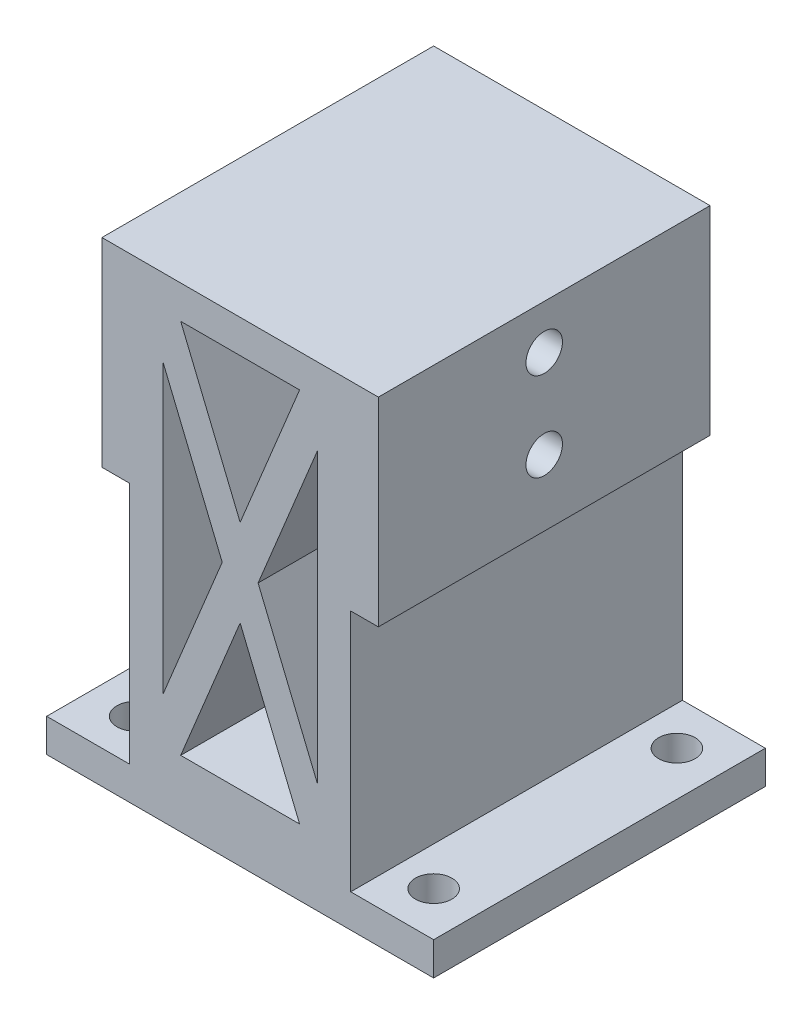
ISO-10303-21;
HEADER;
FILE_DESCRIPTION(('STEP AP214'),'2;1');
FILE_NAME('part.step','',(''),(''),'','','');
FILE_SCHEMA(('AUTOMOTIVE_DESIGN { 1 0 10303 214 1 1 1 1 }'));
ENDSEC;
DATA;
#1=APPLICATION_CONTEXT('core data for automotive mechanical design processes');
#2=APPLICATION_PROTOCOL_DEFINITION('international standard','automotive_design',2000,#1);
#3=PRODUCT_CONTEXT('',#1,'mechanical');
#4=PRODUCT('Part','Part','',(#3));
#5=PRODUCT_RELATED_PRODUCT_CATEGORY('part','',(#4));
#6=PRODUCT_DEFINITION_FORMATION('','',#4);
#7=PRODUCT_DEFINITION_CONTEXT('part definition',#1,'design');
#8=PRODUCT_DEFINITION('design','',#6,#7);
#9=PRODUCT_DEFINITION_SHAPE('','',#8);
#10=(LENGTH_UNIT() NAMED_UNIT(*) SI_UNIT(.MILLI.,.METRE.));
#11=(NAMED_UNIT(*) PLANE_ANGLE_UNIT() SI_UNIT($,.RADIAN.));
#12=(NAMED_UNIT(*) SI_UNIT($,.STERADIAN.) SOLID_ANGLE_UNIT());
#13=UNCERTAINTY_MEASURE_WITH_UNIT(LENGTH_MEASURE(1.E-05),#10,'distance_accuracy_value','');
#14=(GEOMETRIC_REPRESENTATION_CONTEXT(3) GLOBAL_UNCERTAINTY_ASSIGNED_CONTEXT((#13)) GLOBAL_UNIT_ASSIGNED_CONTEXT((#10,
#11,#12)) REPRESENTATION_CONTEXT('',''));
#15=CARTESIAN_POINT('',(0.,0.,0.));
#16=DIRECTION('',(0.,0.,1.));
#17=DIRECTION('',(1.,0.,0.));
#18=AXIS2_PLACEMENT_3D('',#15,#16,#17);
#19=CARTESIAN_POINT('',(0.,38.5,41.6686633500967));
#20=DIRECTION('',(0.,1.,0.));
#21=DIRECTION('',(0.,0.,1.));
#22=AXIS2_PLACEMENT_3D('',#19,#20,#21);
#23=PLANE('',#22);
#24=DIRECTION('',(0.,0.,-1.));
#25=VECTOR('',#24,1.);
#26=CARTESIAN_POINT('',(5.37781385492498,38.5,41.6686633500967));
#27=LINE('',#26,#25);
#28=CARTESIAN_POINT('',(5.37781385492498,38.5,-1.31244047484067));
#29=VERTEX_POINT('',#28);
#30=CARTESIAN_POINT('',(5.37781385492498,38.5,-15.));
#31=VERTEX_POINT('',#30);
#32=EDGE_CURVE('E295',#29,#31,#27,.T.);
#33=ORIENTED_EDGE('',*,*,#32,.F.);
#34=DIRECTION('',(-1.,0.,0.));
#35=VECTOR('',#34,1.);
#36=CARTESIAN_POINT('',(17.1669047558312,38.5,-1.31244047484067));
#37=LINE('',#36,#35);
#38=CARTESIAN_POINT('',(-5.37781385492498,38.5,-1.31244047484066));
#39=VERTEX_POINT('',#38);
#40=EDGE_CURVE('E285',#29,#39,#37,.T.);
#41=ORIENTED_EDGE('',*,*,#40,.T.);
#42=DIRECTION('',(0.,0.,-1.));
#43=VECTOR('',#42,1.);
#44=CARTESIAN_POINT('',(-5.37781385492498,38.5,41.6686633500967));
#45=LINE('',#44,#43);
#46=CARTESIAN_POINT('',(-5.37781385492498,38.5,-15.));
#47=VERTEX_POINT('',#46);
#48=EDGE_CURVE('E293',#39,#47,#45,.T.);
#49=ORIENTED_EDGE('',*,*,#48,.T.);
#50=DIRECTION('',(1.,0.,0.));
#51=VECTOR('',#50,1.);
#52=CARTESIAN_POINT('',(0.,38.5,-15.));
#53=LINE('',#52,#51);
#54=EDGE_CURVE('E306',#47,#31,#53,.T.);
#55=ORIENTED_EDGE('',*,*,#54,.T.);
#56=EDGE_LOOP('',(#33,#41,#49,#55));
#57=FACE_BOUND('',#56,.T.);
#58=ADVANCED_FACE('F112',(#57),#23,.F.);
#59=CARTESIAN_POINT('',(-17.5,1.5,-15.));
#60=DIRECTION('',(0.,0.,1.));
#61=DIRECTION('',(1.,0.,0.));
#62=AXIS2_PLACEMENT_3D('',#59,#60,#61);
#63=PLANE('',#62);
#64=DIRECTION('',(0.380749805254295,0.924678098474716,0.));
#65=VECTOR('',#64,1.);
#66=CARTESIAN_POINT('',(-8.95654377493101,3.68798861320689,-15.));
#67=LINE('',#66,#65);
#68=CARTESIAN_POINT('',(0.,25.4395949237536,-15.));
#69=VERTEX_POINT('',#68);
#70=EDGE_CURVE('E506',#69,#31,#67,.T.);
#71=ORIENTED_EDGE('',*,*,#70,.T.);
#72=ORIENTED_EDGE('',*,*,#54,.F.);
#73=DIRECTION('',(-0.380749805254295,0.924678098474716,0.));
#74=VECTOR('',#73,1.);
#75=CARTESIAN_POINT('',(8.956543774931,3.68798861320688,-15.));
#76=LINE('',#75,#74);
#77=EDGE_CURVE('E301',#69,#47,#76,.T.);
#78=ORIENTED_EDGE('',*,*,#77,.F.);
#79=EDGE_LOOP('',(#71,#72,#78));
#80=FACE_BOUND('',#79,.T.);
#81=DIRECTION('',(-1.,0.,0.));
#82=VECTOR('',#81,1.);
#83=CARTESIAN_POINT('',(-17.5,-1.5,-15.));
#84=LINE('',#83,#82);
#85=CARTESIAN_POINT('',(17.5,-1.5,-15.));
#86=VERTEX_POINT('',#85);
#87=CARTESIAN_POINT('',(-17.5,-1.5,-15.));
#88=VERTEX_POINT('',#87);
#89=EDGE_CURVE('E411',#86,#88,#84,.T.);
#90=ORIENTED_EDGE('',*,*,#89,.T.);
#91=DIRECTION('',(0.,-1.,0.));
#92=VECTOR('',#91,1.);
#93=CARTESIAN_POINT('',(-17.5,1.5,-15.));
#94=LINE('',#93,#92);
#95=CARTESIAN_POINT('',(-17.5,1.5,-15.));
#96=VERTEX_POINT('',#95);
#97=EDGE_CURVE('E421',#96,#88,#94,.T.);
#98=ORIENTED_EDGE('',*,*,#97,.F.);
#99=DIRECTION('',(-1.,0.,0.));
#100=VECTOR('',#99,1.);
#101=CARTESIAN_POINT('',(-17.5,1.5,-15.));
#102=LINE('',#101,#100);
#103=CARTESIAN_POINT('',(-10.,1.5,-15.));
#104=VERTEX_POINT('',#103);
#105=EDGE_CURVE('E397',#104,#96,#102,.T.);
#106=ORIENTED_EDGE('',*,*,#105,.F.);
#107=DIRECTION('',(0.,-1.,0.));
#108=VECTOR('',#107,1.);
#109=CARTESIAN_POINT('',(-10.,41.5,-15.));
#110=LINE('',#109,#108);
#111=CARTESIAN_POINT('',(-10.,23.5,-15.));
#112=VERTEX_POINT('',#111);
#113=EDGE_CURVE('E365',#112,#104,#110,.T.);
#114=ORIENTED_EDGE('',*,*,#113,.F.);
#115=DIRECTION('',(1.,0.,0.));
#116=VECTOR('',#115,1.);
#117=CARTESIAN_POINT('',(-12.5,23.5,-15.));
#118=LINE('',#117,#116);
#119=CARTESIAN_POINT('',(-12.5,23.5,-15.));
#120=VERTEX_POINT('',#119);
#121=EDGE_CURVE('E327',#120,#112,#118,.T.);
#122=ORIENTED_EDGE('',*,*,#121,.F.);
#123=DIRECTION('',(0.,1.,0.));
#124=VECTOR('',#123,1.);
#125=CARTESIAN_POINT('',(-12.5,0.,-15.));
#126=LINE('',#125,#124);
#127=CARTESIAN_POINT('',(-12.5,41.5,-15.));
#128=VERTEX_POINT('',#127);
#129=EDGE_CURVE('E324',#120,#128,#126,.T.);
#130=ORIENTED_EDGE('',*,*,#129,.T.);
#131=DIRECTION('',(-1.,0.,0.));
#132=VECTOR('',#131,1.);
#133=CARTESIAN_POINT('',(-10.,41.5,-15.));
#134=LINE('',#133,#132);
#135=CARTESIAN_POINT('',(12.5,41.5,-15.));
#136=VERTEX_POINT('',#135);
#137=EDGE_CURVE('E352',#136,#128,#134,.T.);
#138=ORIENTED_EDGE('',*,*,#137,.F.);
#139=DIRECTION('',(0.,1.,0.));
#140=VECTOR('',#139,1.);
#141=CARTESIAN_POINT('',(12.5,0.,-15.));
#142=LINE('',#141,#140);
#143=CARTESIAN_POINT('',(12.5,23.5,-15.));
#144=VERTEX_POINT('',#143);
#145=EDGE_CURVE('E337',#144,#136,#142,.T.);
#146=ORIENTED_EDGE('',*,*,#145,.F.);
#147=DIRECTION('',(-1.,0.,0.));
#148=VECTOR('',#147,1.);
#149=CARTESIAN_POINT('',(12.5,23.5,-15.));
#150=LINE('',#149,#148);
#151=CARTESIAN_POINT('',(10.,23.5,-15.));
#152=VERTEX_POINT('',#151);
#153=EDGE_CURVE('E349',#144,#152,#150,.T.);
#154=ORIENTED_EDGE('',*,*,#153,.T.);
#155=DIRECTION('',(0.,-1.,0.));
#156=VECTOR('',#155,1.);
#157=CARTESIAN_POINT('',(10.,41.5,-15.));
#158=LINE('',#157,#156);
#159=CARTESIAN_POINT('',(10.,1.5,-15.));
#160=VERTEX_POINT('',#159);
#161=EDGE_CURVE('E367',#152,#160,#158,.T.);
#162=ORIENTED_EDGE('',*,*,#161,.T.);
#163=CARTESIAN_POINT('',(17.5,1.5,-15.));
#164=VERTEX_POINT('',#163);
#165=EDGE_CURVE('E399',#164,#160,#102,.T.);
#166=ORIENTED_EDGE('',*,*,#165,.F.);
#167=DIRECTION('',(0.,-1.,0.));
#168=VECTOR('',#167,1.);
#169=CARTESIAN_POINT('',(17.5,1.5,-15.));
#170=LINE('',#169,#168);
#171=EDGE_CURVE('E120',#164,#86,#170,.T.);
#172=ORIENTED_EDGE('',*,*,#171,.T.);
#173=EDGE_LOOP('',(#90,#98,#106,#114,#122,#130,#138,#146,#154,#162,#166,#172));
#174=FACE_BOUND('',#173,.T.);
#175=DIRECTION('',(0.380749805254295,-0.924678098474716,0.));
#176=VECTOR('',#175,1.);
#177=CARTESIAN_POINT('',(6.18250947950686,2.545739197444,-15.));
#178=LINE('',#177,#176);
#179=CARTESIAN_POINT('',(0.,17.5604050762464,-15.));
#180=VERTEX_POINT('',#179);
#181=CARTESIAN_POINT('',(5.37781385492497,4.5,-15.));
#182=VERTEX_POINT('',#181);
#183=EDGE_CURVE('E470',#180,#182,#178,.T.);
#184=ORIENTED_EDGE('',*,*,#183,.F.);
#185=DIRECTION('',(0.380749805254295,0.924678098474716,0.));
#186=VECTOR('',#185,1.);
#187=CARTESIAN_POINT('',(-6.18250947950687,2.545739197444,-15.));
#188=LINE('',#187,#186);
#189=CARTESIAN_POINT('',(-5.37781385492499,4.5,-15.));
#190=VERTEX_POINT('',#189);
#191=EDGE_CURVE('E461',#190,#180,#188,.T.);
#192=ORIENTED_EDGE('',*,*,#191,.F.);
#193=DIRECTION('',(1.,0.,0.));
#194=VECTOR('',#193,1.);
#195=CARTESIAN_POINT('',(0.,4.5,-15.));
#196=LINE('',#195,#194);
#197=EDGE_CURVE('E473',#190,#182,#196,.T.);
#198=ORIENTED_EDGE('',*,*,#197,.T.);
#199=EDGE_LOOP('',(#184,#192,#198));
#200=FACE_BOUND('',#199,.T.);
#201=DIRECTION('',(-0.380749805254295,0.924678098474716,0.));
#202=VECTOR('',#201,1.);
#203=CARTESIAN_POINT('',(8.956543774931,3.68798861320688,-15.));
#204=LINE('',#203,#202);
#205=CARTESIAN_POINT('',(7.,8.4395949237536,-15.));
#206=VERTEX_POINT('',#205);
#207=CARTESIAN_POINT('',(1.62218614507502,21.5,-15.));
#208=VERTEX_POINT('',#207);
#209=EDGE_CURVE('E514',#206,#208,#204,.T.);
#210=ORIENTED_EDGE('',*,*,#209,.F.);
#211=DIRECTION('',(0.,-1.,0.));
#212=VECTOR('',#211,1.);
#213=CARTESIAN_POINT('',(7.,0.,-15.));
#214=LINE('',#213,#212);
#215=CARTESIAN_POINT('',(7.,34.5604050762464,-15.));
#216=VERTEX_POINT('',#215);
#217=EDGE_CURVE('E483',#216,#206,#214,.T.);
#218=ORIENTED_EDGE('',*,*,#217,.F.);
#219=DIRECTION('',(0.380749805254295,0.924678098474716,0.));
#220=VECTOR('',#219,1.);
#221=CARTESIAN_POINT('',(-6.18250947950687,2.545739197444,-15.));
#222=LINE('',#221,#220);
#223=EDGE_CURVE('E517',#208,#216,#222,.T.);
#224=ORIENTED_EDGE('',*,*,#223,.F.);
#225=EDGE_LOOP('',(#210,#218,#224));
#226=FACE_BOUND('',#225,.T.);
#227=DIRECTION('',(0.,-1.,0.));
#228=VECTOR('',#227,1.);
#229=CARTESIAN_POINT('',(-7.00000000000001,0.,-15.));
#230=LINE('',#229,#228);
#231=CARTESIAN_POINT('',(-7.00000000000001,34.5604050762464,-15.));
#232=VERTEX_POINT('',#231);
#233=CARTESIAN_POINT('',(-7.00000000000001,8.43959492375361,-15.));
#234=VERTEX_POINT('',#233);
#235=EDGE_CURVE('E134',#232,#234,#230,.T.);
#236=ORIENTED_EDGE('',*,*,#235,.T.);
#237=DIRECTION('',(0.380749805254295,0.924678098474716,0.));
#238=VECTOR('',#237,1.);
#239=CARTESIAN_POINT('',(-8.95654377493101,3.68798861320689,-15.));
#240=LINE('',#239,#238);
#241=CARTESIAN_POINT('',(-1.62218614507502,21.5,-15.));
#242=VERTEX_POINT('',#241);
#243=EDGE_CURVE('E497',#234,#242,#240,.T.);
#244=ORIENTED_EDGE('',*,*,#243,.T.);
#245=DIRECTION('',(0.380749805254295,-0.924678098474716,0.));
#246=VECTOR('',#245,1.);
#247=CARTESIAN_POINT('',(6.18250947950686,2.545739197444,-15.));
#248=LINE('',#247,#246);
#249=EDGE_CURVE('E493',#232,#242,#248,.T.);
#250=ORIENTED_EDGE('',*,*,#249,.F.);
#251=EDGE_LOOP('',(#236,#244,#250));
#252=FACE_BOUND('',#251,.T.);
#253=ADVANCED_FACE('F535',(#80,#174,#200,#226,#252),#63,.F.);
#254=CARTESIAN_POINT('',(-17.5,1.5,15.));
#255=DIRECTION('',(0.,0.,-1.));
#256=DIRECTION('',(-1.,0.,0.));
#257=AXIS2_PLACEMENT_3D('',#254,#255,#256);
#258=PLANE('',#257);
#259=DIRECTION('',(-0.380749805254295,-0.924678098474716,0.));
#260=VECTOR('',#259,1.);
#261=CARTESIAN_POINT('',(-8.95654377493101,3.68798861320689,15.));
#262=LINE('',#261,#260);
#263=CARTESIAN_POINT('',(5.37781385492498,38.5,15.));
#264=VERTEX_POINT('',#263);
#265=CARTESIAN_POINT('',(0.,25.4395949237536,15.));
#266=VERTEX_POINT('',#265);
#267=EDGE_CURVE('E315',#264,#266,#262,.T.);
#268=ORIENTED_EDGE('',*,*,#267,.T.);
#269=DIRECTION('',(0.380749805254295,-0.924678098474716,0.));
#270=VECTOR('',#269,1.);
#271=CARTESIAN_POINT('',(8.956543774931,3.68798861320688,15.));
#272=LINE('',#271,#270);
#273=CARTESIAN_POINT('',(-5.37781385492498,38.5,15.));
#274=VERTEX_POINT('',#273);
#275=EDGE_CURVE('E312',#274,#266,#272,.T.);
#276=ORIENTED_EDGE('',*,*,#275,.F.);
#277=DIRECTION('',(-1.,0.,0.));
#278=VECTOR('',#277,1.);
#279=CARTESIAN_POINT('',(0.,38.5,15.));
#280=LINE('',#279,#278);
#281=EDGE_CURVE('E527',#264,#274,#280,.T.);
#282=ORIENTED_EDGE('',*,*,#281,.F.);
#283=EDGE_LOOP('',(#268,#276,#282));
#284=FACE_BOUND('',#283,.T.);
#285=DIRECTION('',(1.,0.,0.));
#286=VECTOR('',#285,1.);
#287=CARTESIAN_POINT('',(-17.5,-1.5,15.));
#288=LINE('',#287,#286);
#289=CARTESIAN_POINT('',(-17.5,-1.5,15.));
#290=VERTEX_POINT('',#289);
#291=CARTESIAN_POINT('',(17.5,-1.5,15.));
#292=VERTEX_POINT('',#291);
#293=EDGE_CURVE('E398',#290,#292,#288,.T.);
#294=ORIENTED_EDGE('',*,*,#293,.T.);
#295=DIRECTION('',(0.,-1.,0.));
#296=VECTOR('',#295,1.);
#297=CARTESIAN_POINT('',(17.5,1.5,15.));
#298=LINE('',#297,#296);
#299=CARTESIAN_POINT('',(17.5,1.5,15.));
#300=VERTEX_POINT('',#299);
#301=EDGE_CURVE('E408',#300,#292,#298,.T.);
#302=ORIENTED_EDGE('',*,*,#301,.F.);
#303=DIRECTION('',(1.,0.,0.));
#304=VECTOR('',#303,1.);
#305=CARTESIAN_POINT('',(-17.5,1.5,15.));
#306=LINE('',#305,#304);
#307=CARTESIAN_POINT('',(10.,1.5,15.));
#308=VERTEX_POINT('',#307);
#309=EDGE_CURVE('E404',#308,#300,#306,.T.);
#310=ORIENTED_EDGE('',*,*,#309,.F.);
#311=DIRECTION('',(0.,-1.,0.));
#312=VECTOR('',#311,1.);
#313=CARTESIAN_POINT('',(10.,41.5,15.));
#314=LINE('',#313,#312);
#315=CARTESIAN_POINT('',(10.,23.5,15.));
#316=VERTEX_POINT('',#315);
#317=EDGE_CURVE('E357',#316,#308,#314,.T.);
#318=ORIENTED_EDGE('',*,*,#317,.F.);
#319=DIRECTION('',(-1.,0.,0.));
#320=VECTOR('',#319,1.);
#321=CARTESIAN_POINT('',(12.5,23.5,15.));
#322=LINE('',#321,#320);
#323=CARTESIAN_POINT('',(12.5,23.5,15.));
#324=VERTEX_POINT('',#323);
#325=EDGE_CURVE('E345',#324,#316,#322,.T.);
#326=ORIENTED_EDGE('',*,*,#325,.F.);
#327=DIRECTION('',(0.,-1.,0.));
#328=VECTOR('',#327,1.);
#329=CARTESIAN_POINT('',(12.5,0.,15.));
#330=LINE('',#329,#328);
#331=CARTESIAN_POINT('',(12.5,41.5,15.));
#332=VERTEX_POINT('',#331);
#333=EDGE_CURVE('E343',#332,#324,#330,.T.);
#334=ORIENTED_EDGE('',*,*,#333,.F.);
#335=DIRECTION('',(1.,0.,0.));
#336=VECTOR('',#335,1.);
#337=CARTESIAN_POINT('',(-10.,41.5,15.));
#338=LINE('',#337,#336);
#339=CARTESIAN_POINT('',(-12.5,41.5,15.));
#340=VERTEX_POINT('',#339);
#341=EDGE_CURVE('E354',#340,#332,#338,.T.);
#342=ORIENTED_EDGE('',*,*,#341,.F.);
#343=DIRECTION('',(0.,-1.,0.));
#344=VECTOR('',#343,1.);
#345=CARTESIAN_POINT('',(-12.5,0.,15.));
#346=LINE('',#345,#344);
#347=CARTESIAN_POINT('',(-12.5,23.5,15.));
#348=VERTEX_POINT('',#347);
#349=EDGE_CURVE('E318',#340,#348,#346,.T.);
#350=ORIENTED_EDGE('',*,*,#349,.T.);
#351=DIRECTION('',(1.,0.,0.));
#352=VECTOR('',#351,1.);
#353=CARTESIAN_POINT('',(-12.5,23.5,15.));
#354=LINE('',#353,#352);
#355=CARTESIAN_POINT('',(-10.,23.5,15.));
#356=VERTEX_POINT('',#355);
#357=EDGE_CURVE('E331',#348,#356,#354,.T.);
#358=ORIENTED_EDGE('',*,*,#357,.T.);
#359=DIRECTION('',(0.,-1.,0.));
#360=VECTOR('',#359,1.);
#361=CARTESIAN_POINT('',(-10.,41.5,15.));
#362=LINE('',#361,#360);
#363=CARTESIAN_POINT('',(-10.,1.5,15.));
#364=VERTEX_POINT('',#363);
#365=EDGE_CURVE('E363',#356,#364,#362,.T.);
#366=ORIENTED_EDGE('',*,*,#365,.T.);
#367=CARTESIAN_POINT('',(-17.5,1.5,15.));
#368=VERTEX_POINT('',#367);
#369=EDGE_CURVE('E405',#368,#364,#306,.T.);
#370=ORIENTED_EDGE('',*,*,#369,.F.);
#371=DIRECTION('',(0.,-1.,0.));
#372=VECTOR('',#371,1.);
#373=CARTESIAN_POINT('',(-17.5,1.5,15.));
#374=LINE('',#373,#372);
#375=EDGE_CURVE('E418',#368,#290,#374,.T.);
#376=ORIENTED_EDGE('',*,*,#375,.T.);
#377=EDGE_LOOP('',(#294,#302,#310,#318,#326,#334,#342,#350,#358,#366,#370,#376));
#378=FACE_BOUND('',#377,.T.);
#379=DIRECTION('',(-1.,0.,0.));
#380=VECTOR('',#379,1.);
#381=CARTESIAN_POINT('',(0.,4.5,15.));
#382=LINE('',#381,#380);
#383=CARTESIAN_POINT('',(5.37781385492497,4.5,15.));
#384=VERTEX_POINT('',#383);
#385=CARTESIAN_POINT('',(-5.37781385492499,4.5,15.));
#386=VERTEX_POINT('',#385);
#387=EDGE_CURVE('E462',#384,#386,#382,.T.);
#388=ORIENTED_EDGE('',*,*,#387,.T.);
#389=DIRECTION('',(-0.380749805254295,-0.924678098474716,0.));
#390=VECTOR('',#389,1.);
#391=CARTESIAN_POINT('',(-6.18250947950687,2.545739197444,15.));
#392=LINE('',#391,#390);
#393=CARTESIAN_POINT('',(0.,17.5604050762464,15.));
#394=VERTEX_POINT('',#393);
#395=EDGE_CURVE('E465',#394,#386,#392,.T.);
#396=ORIENTED_EDGE('',*,*,#395,.F.);
#397=DIRECTION('',(-0.380749805254295,0.924678098474716,0.));
#398=VECTOR('',#397,1.);
#399=CARTESIAN_POINT('',(6.18250947950686,2.545739197444,15.));
#400=LINE('',#399,#398);
#401=EDGE_CURVE('E468',#384,#394,#400,.T.);
#402=ORIENTED_EDGE('',*,*,#401,.F.);
#403=EDGE_LOOP('',(#388,#396,#402));
#404=FACE_BOUND('',#403,.T.);
#405=DIRECTION('',(-0.380749805254295,-0.924678098474716,0.));
#406=VECTOR('',#405,1.);
#407=CARTESIAN_POINT('',(-6.18250947950687,2.545739197444,15.));
#408=LINE('',#407,#406);
#409=CARTESIAN_POINT('',(7.,34.5604050762464,15.));
#410=VERTEX_POINT('',#409);
#411=CARTESIAN_POINT('',(1.62218614507502,21.5,15.));
#412=VERTEX_POINT('',#411);
#413=EDGE_CURVE('E507',#410,#412,#408,.T.);
#414=ORIENTED_EDGE('',*,*,#413,.F.);
#415=DIRECTION('',(0.,1.,0.));
#416=VECTOR('',#415,1.);
#417=CARTESIAN_POINT('',(7.,0.,15.));
#418=LINE('',#417,#416);
#419=CARTESIAN_POINT('',(7.,8.4395949237536,15.));
#420=VERTEX_POINT('',#419);
#421=EDGE_CURVE('E510',#420,#410,#418,.T.);
#422=ORIENTED_EDGE('',*,*,#421,.F.);
#423=DIRECTION('',(0.380749805254295,-0.924678098474716,0.));
#424=VECTOR('',#423,1.);
#425=CARTESIAN_POINT('',(8.956543774931,3.68798861320688,15.));
#426=LINE('',#425,#424);
#427=EDGE_CURVE('E494',#412,#420,#426,.T.);
#428=ORIENTED_EDGE('',*,*,#427,.F.);
#429=EDGE_LOOP('',(#414,#422,#428));
#430=FACE_BOUND('',#429,.T.);
#431=DIRECTION('',(0.,1.,0.));
#432=VECTOR('',#431,1.);
#433=CARTESIAN_POINT('',(-7.00000000000001,0.,15.));
#434=LINE('',#433,#432);
#435=CARTESIAN_POINT('',(-7.00000000000001,8.43959492375361,15.));
#436=VERTEX_POINT('',#435);
#437=CARTESIAN_POINT('',(-7.00000000000001,34.5604050762464,15.));
#438=VERTEX_POINT('',#437);
#439=EDGE_CURVE('E487',#436,#438,#434,.T.);
#440=ORIENTED_EDGE('',*,*,#439,.T.);
#441=DIRECTION('',(-0.380749805254295,0.924678098474716,0.));
#442=VECTOR('',#441,1.);
#443=CARTESIAN_POINT('',(6.18250947950686,2.545739197444,15.));
#444=LINE('',#443,#442);
#445=CARTESIAN_POINT('',(-1.62218614507503,21.5,15.));
#446=VERTEX_POINT('',#445);
#447=EDGE_CURVE('E491',#446,#438,#444,.T.);
#448=ORIENTED_EDGE('',*,*,#447,.F.);
#449=DIRECTION('',(-0.380749805254295,-0.924678098474716,0.));
#450=VECTOR('',#449,1.);
#451=CARTESIAN_POINT('',(-8.95654377493101,3.68798861320689,15.));
#452=LINE('',#451,#450);
#453=EDGE_CURVE('E484',#446,#436,#452,.T.);
#454=ORIENTED_EDGE('',*,*,#453,.T.);
#455=EDGE_LOOP('',(#440,#448,#454));
#456=FACE_BOUND('',#455,.T.);
#457=ADVANCED_FACE('F544',(#284,#378,#404,#430,#456),#258,.F.);
#458=CARTESIAN_POINT('',(-10.,41.5,15.));
#459=DIRECTION('',(1.,0.,0.));
#460=DIRECTION('',(0.,0.,-1.));
#461=AXIS2_PLACEMENT_3D('',#458,#459,#460);
#462=PLANE('',#461);
#463=DIRECTION('',(0.,0.,1.));
#464=VECTOR('',#463,1.);
#465=CARTESIAN_POINT('',(-10.,23.5,0.));
#466=LINE('',#465,#464);
#467=EDGE_CURVE('E314',#112,#356,#466,.T.);
#468=ORIENTED_EDGE('',*,*,#467,.F.);
#469=ORIENTED_EDGE('',*,*,#113,.T.);
#470=DIRECTION('',(0.,0.,1.));
#471=VECTOR('',#470,1.);
#472=CARTESIAN_POINT('',(-10.,1.5,15.));
#473=LINE('',#472,#471);
#474=EDGE_CURVE('E355',#104,#364,#473,.T.);
#475=ORIENTED_EDGE('',*,*,#474,.T.);
#476=ORIENTED_EDGE('',*,*,#365,.F.);
#477=EDGE_LOOP('',(#468,#469,#475,#476));
#478=FACE_BOUND('',#477,.T.);
#479=ADVANCED_FACE('F569',(#478),#462,.F.);
#480=CARTESIAN_POINT('',(0.,1.5,0.));
#481=DIRECTION('',(0.,-1.,0.));
#482=DIRECTION('',(0.,0.,-1.));
#483=AXIS2_PLACEMENT_3D('',#480,#481,#482);
#484=PLANE('',#483);
#485=CARTESIAN_POINT('',(13.5,1.5,-11.));
#486=DIRECTION('',(0.,1.,0.));
#487=DIRECTION('',(0.,0.,-1.));
#488=AXIS2_PLACEMENT_3D('',#485,#486,#487);
#489=CIRCLE('',#488,1.65);
#490=CARTESIAN_POINT('',(13.5,1.5,-12.65));
#491=VERTEX_POINT('',#490);
#492=EDGE_CURVE('E370',#491,#491,#489,.T.);
#493=ORIENTED_EDGE('',*,*,#492,.F.);
#494=EDGE_LOOP('',(#493));
#495=FACE_BOUND('',#494,.T.);
#496=CARTESIAN_POINT('',(13.5,1.5,11.));
#497=DIRECTION('',(0.,1.,0.));
#498=DIRECTION('',(0.,0.,1.));
#499=AXIS2_PLACEMENT_3D('',#496,#497,#498);
#500=CIRCLE('',#499,1.65);
#501=CARTESIAN_POINT('',(13.5,1.5,12.65));
#502=VERTEX_POINT('',#501);
#503=EDGE_CURVE('E378',#502,#502,#500,.T.);
#504=ORIENTED_EDGE('',*,*,#503,.F.);
#505=EDGE_LOOP('',(#504));
#506=FACE_BOUND('',#505,.T.);
#507=DIRECTION('',(0.,0.,-1.));
#508=VECTOR('',#507,1.);
#509=CARTESIAN_POINT('',(10.,1.5,15.));
#510=LINE('',#509,#508);
#511=EDGE_CURVE('E351',#308,#160,#510,.T.);
#512=ORIENTED_EDGE('',*,*,#511,.F.);
#513=ORIENTED_EDGE('',*,*,#309,.T.);
#514=DIRECTION('',(0.,0.,-1.));
#515=VECTOR('',#514,1.);
#516=CARTESIAN_POINT('',(17.5,1.5,15.));
#517=LINE('',#516,#515);
#518=EDGE_CURVE('E394',#300,#164,#517,.T.);
#519=ORIENTED_EDGE('',*,*,#518,.T.);
#520=ORIENTED_EDGE('',*,*,#165,.T.);
#521=EDGE_LOOP('',(#512,#513,#519,#520));
#522=FACE_BOUND('',#521,.T.);
#523=ADVANCED_FACE('F581',(#495,#506,#522),#484,.F.);
#524=CARTESIAN_POINT('',(-13.5,1.5,-11.));
#525=DIRECTION('',(0.,1.,0.));
#526=DIRECTION('',(0.,0.,1.));
#527=AXIS2_PLACEMENT_3D('',#524,#525,#526);
#528=CIRCLE('',#527,1.65);
#529=CARTESIAN_POINT('',(-13.5,1.5,-9.34999999999999));
#530=VERTEX_POINT('',#529);
#531=EDGE_CURVE('E377',#530,#530,#528,.T.);
#532=ORIENTED_EDGE('',*,*,#531,.F.);
#533=EDGE_LOOP('',(#532));
#534=FACE_BOUND('',#533,.T.);
#535=CARTESIAN_POINT('',(-13.5,1.5,11.));
#536=DIRECTION('',(0.,1.,0.));
#537=DIRECTION('',(0.,0.,-1.));
#538=AXIS2_PLACEMENT_3D('',#535,#536,#537);
#539=CIRCLE('',#538,1.65);
#540=CARTESIAN_POINT('',(-13.5,1.5,9.35));
#541=VERTEX_POINT('',#540);
#542=EDGE_CURVE('E369',#541,#541,#539,.T.);
#543=ORIENTED_EDGE('',*,*,#542,.F.);
#544=EDGE_LOOP('',(#543));
#545=FACE_BOUND('',#544,.T.);
#546=ORIENTED_EDGE('',*,*,#474,.F.);
#547=ORIENTED_EDGE('',*,*,#105,.T.);
#548=DIRECTION('',(0.,0.,1.));
#549=VECTOR('',#548,1.);
#550=CARTESIAN_POINT('',(-17.5,1.5,15.));
#551=LINE('',#550,#549);
#552=EDGE_CURVE('E402',#96,#368,#551,.T.);
#553=ORIENTED_EDGE('',*,*,#552,.T.);
#554=ORIENTED_EDGE('',*,*,#369,.T.);
#555=EDGE_LOOP('',(#546,#547,#553,#554));
#556=FACE_BOUND('',#555,.T.);
#557=ADVANCED_FACE('F584',(#534,#545,#556),#484,.F.);
#558=CARTESIAN_POINT('',(17.5,1.5,15.));
#559=DIRECTION('',(-1.,0.,0.));
#560=DIRECTION('',(0.,0.,1.));
#561=AXIS2_PLACEMENT_3D('',#558,#559,#560);
#562=PLANE('',#561);
#563=DIRECTION('',(0.,0.,-1.));
#564=VECTOR('',#563,1.);
#565=CARTESIAN_POINT('',(17.5,-1.5,15.));
#566=LINE('',#565,#564);
#567=EDGE_CURVE('E393',#292,#86,#566,.T.);
#568=ORIENTED_EDGE('',*,*,#567,.T.);
#569=ORIENTED_EDGE('',*,*,#171,.F.);
#570=ORIENTED_EDGE('',*,*,#518,.F.);
#571=ORIENTED_EDGE('',*,*,#301,.T.);
#572=EDGE_LOOP('',(#568,#569,#570,#571));
#573=FACE_BOUND('',#572,.T.);
#574=ADVANCED_FACE('F114',(#573),#562,.F.);
#575=CARTESIAN_POINT('',(-17.5,1.5,15.));
#576=DIRECTION('',(1.,0.,0.));
#577=DIRECTION('',(0.,0.,-1.));
#578=AXIS2_PLACEMENT_3D('',#575,#576,#577);
#579=PLANE('',#578);
#580=DIRECTION('',(0.,0.,1.));
#581=VECTOR('',#580,1.);
#582=CARTESIAN_POINT('',(-17.5,-1.5,15.));
#583=LINE('',#582,#581);
#584=EDGE_CURVE('E413',#88,#290,#583,.T.);
#585=ORIENTED_EDGE('',*,*,#584,.T.);
#586=ORIENTED_EDGE('',*,*,#375,.F.);
#587=ORIENTED_EDGE('',*,*,#552,.F.);
#588=ORIENTED_EDGE('',*,*,#97,.T.);
#589=EDGE_LOOP('',(#585,#586,#587,#588));
#590=FACE_BOUND('',#589,.T.);
#591=ADVANCED_FACE('F572',(#590),#579,.F.);
#592=CARTESIAN_POINT('',(0.,-1.5,0.));
#593=DIRECTION('',(0.,-1.,0.));
#594=DIRECTION('',(0.,0.,-1.));
#595=AXIS2_PLACEMENT_3D('',#592,#593,#594);
#596=PLANE('',#595);
#597=CARTESIAN_POINT('',(-13.5,-1.5,11.));
#598=DIRECTION('',(0.,-1.,0.));
#599=DIRECTION('',(0.,0.,-1.));
#600=AXIS2_PLACEMENT_3D('',#597,#598,#599);
#601=CIRCLE('',#600,1.65);
#602=CARTESIAN_POINT('',(-13.5,-1.5,9.35));
#603=VERTEX_POINT('',#602);
#604=EDGE_CURVE('E381',#603,#603,#601,.F.);
#605=ORIENTED_EDGE('',*,*,#604,.T.);
#606=EDGE_LOOP('',(#605));
#607=FACE_BOUND('',#606,.T.);
#608=CARTESIAN_POINT('',(13.5,-1.5,11.));
#609=DIRECTION('',(0.,-1.,0.));
#610=DIRECTION('',(0.,0.,-1.));
#611=AXIS2_PLACEMENT_3D('',#608,#609,#610);
#612=CIRCLE('',#611,1.65);
#613=CARTESIAN_POINT('',(13.5,-1.5,9.34999999999999));
#614=VERTEX_POINT('',#613);
#615=EDGE_CURVE('E374',#614,#614,#612,.F.);
#616=ORIENTED_EDGE('',*,*,#615,.T.);
#617=EDGE_LOOP('',(#616));
#618=FACE_BOUND('',#617,.T.);
#619=CARTESIAN_POINT('',(13.5,-1.5,-11.));
#620=DIRECTION('',(0.,-1.,0.));
#621=DIRECTION('',(0.,0.,-1.));
#622=AXIS2_PLACEMENT_3D('',#619,#620,#621);
#623=CIRCLE('',#622,1.65);
#624=CARTESIAN_POINT('',(13.5,-1.5,-12.65));
#625=VERTEX_POINT('',#624);
#626=EDGE_CURVE('E373',#625,#625,#623,.F.);
#627=ORIENTED_EDGE('',*,*,#626,.T.);
#628=EDGE_LOOP('',(#627));
#629=FACE_BOUND('',#628,.T.);
#630=CARTESIAN_POINT('',(-13.5,-1.5,-11.));
#631=DIRECTION('',(0.,-1.,0.));
#632=DIRECTION('',(0.,0.,-1.));
#633=AXIS2_PLACEMENT_3D('',#630,#631,#632);
#634=CIRCLE('',#633,1.65);
#635=CARTESIAN_POINT('',(-13.5,-1.5,-12.65));
#636=VERTEX_POINT('',#635);
#637=EDGE_CURVE('E390',#636,#636,#634,.F.);
#638=ORIENTED_EDGE('',*,*,#637,.T.);
#639=EDGE_LOOP('',(#638));
#640=FACE_BOUND('',#639,.T.);
#641=ORIENTED_EDGE('',*,*,#567,.F.);
#642=ORIENTED_EDGE('',*,*,#293,.F.);
#643=ORIENTED_EDGE('',*,*,#584,.F.);
#644=ORIENTED_EDGE('',*,*,#89,.F.);
#645=EDGE_LOOP('',(#641,#642,#643,#644));
#646=FACE_BOUND('',#645,.T.);
#647=ADVANCED_FACE('F574',(#607,#618,#629,#640,#646),#596,.T.);
#648=CARTESIAN_POINT('',(-13.5,-6.16690475583122,-11.));
#649=DIRECTION('',(0.,1.,0.));
#650=DIRECTION('',(0.,0.,1.));
#651=AXIS2_PLACEMENT_3D('',#648,#649,#650);
#652=CYLINDRICAL_SURFACE('',#651,1.65);
#653=ORIENTED_EDGE('',*,*,#531,.T.);
#654=EDGE_LOOP('',(#653));
#655=FACE_BOUND('',#654,.T.);
#656=ORIENTED_EDGE('',*,*,#637,.F.);
#657=EDGE_LOOP('',(#656));
#658=FACE_BOUND('',#657,.T.);
#659=ADVANCED_FACE('F579',(#655,#658),#652,.F.);
#660=CARTESIAN_POINT('',(13.5,-6.16690475583122,-11.));
#661=DIRECTION('',(0.,1.,0.));
#662=DIRECTION('',(0.,0.,1.));
#663=AXIS2_PLACEMENT_3D('',#660,#661,#662);
#664=CYLINDRICAL_SURFACE('',#663,1.65);
#665=ORIENTED_EDGE('',*,*,#492,.T.);
#666=EDGE_LOOP('',(#665));
#667=FACE_BOUND('',#666,.T.);
#668=ORIENTED_EDGE('',*,*,#626,.F.);
#669=EDGE_LOOP('',(#668));
#670=FACE_BOUND('',#669,.T.);
#671=ADVANCED_FACE('F588',(#667,#670),#664,.F.);
#672=CARTESIAN_POINT('',(13.5,-6.16690475583122,11.));
#673=DIRECTION('',(0.,1.,0.));
#674=DIRECTION('',(0.,0.,1.));
#675=AXIS2_PLACEMENT_3D('',#672,#673,#674);
#676=CYLINDRICAL_SURFACE('',#675,1.65);
#677=ORIENTED_EDGE('',*,*,#503,.T.);
#678=EDGE_LOOP('',(#677));
#679=FACE_BOUND('',#678,.T.);
#680=ORIENTED_EDGE('',*,*,#615,.F.);
#681=EDGE_LOOP('',(#680));
#682=FACE_BOUND('',#681,.T.);
#683=ADVANCED_FACE('F594',(#679,#682),#676,.F.);
#684=CARTESIAN_POINT('',(-13.5,-6.16690475583122,11.));
#685=DIRECTION('',(0.,1.,0.));
#686=DIRECTION('',(0.,0.,1.));
#687=AXIS2_PLACEMENT_3D('',#684,#685,#686);
#688=CYLINDRICAL_SURFACE('',#687,1.65);
#689=ORIENTED_EDGE('',*,*,#542,.T.);
#690=EDGE_LOOP('',(#689));
#691=FACE_BOUND('',#690,.T.);
#692=ORIENTED_EDGE('',*,*,#604,.F.);
#693=EDGE_LOOP('',(#692));
#694=FACE_BOUND('',#693,.T.);
#695=ADVANCED_FACE('F590',(#691,#694),#688,.F.);
#696=CARTESIAN_POINT('',(10.,41.5,15.));
#697=DIRECTION('',(-1.,0.,0.));
#698=DIRECTION('',(0.,0.,1.));
#699=AXIS2_PLACEMENT_3D('',#696,#697,#698);
#700=PLANE('',#699);
#701=ORIENTED_EDGE('',*,*,#161,.F.);
#702=DIRECTION('',(0.,0.,1.));
#703=VECTOR('',#702,1.);
#704=CARTESIAN_POINT('',(10.,23.5,0.));
#705=LINE('',#704,#703);
#706=EDGE_CURVE('E333',#152,#316,#705,.T.);
#707=ORIENTED_EDGE('',*,*,#706,.T.);
#708=ORIENTED_EDGE('',*,*,#317,.T.);
#709=ORIENTED_EDGE('',*,*,#511,.T.);
#710=EDGE_LOOP('',(#701,#707,#708,#709));
#711=FACE_BOUND('',#710,.T.);
#712=ADVANCED_FACE('F593',(#711),#700,.F.);
#713=CARTESIAN_POINT('',(0.,41.5,0.));
#714=DIRECTION('',(0.,-1.,0.));
#715=DIRECTION('',(0.,0.,-1.));
#716=AXIS2_PLACEMENT_3D('',#713,#714,#715);
#717=PLANE('',#716);
#718=ORIENTED_EDGE('',*,*,#341,.T.);
#719=DIRECTION('',(0.,0.,1.));
#720=VECTOR('',#719,1.);
#721=CARTESIAN_POINT('',(12.5,41.5,0.));
#722=LINE('',#721,#720);
#723=EDGE_CURVE('E340',#136,#332,#722,.T.);
#724=ORIENTED_EDGE('',*,*,#723,.F.);
#725=ORIENTED_EDGE('',*,*,#137,.T.);
#726=DIRECTION('',(0.,0.,1.));
#727=VECTOR('',#726,1.);
#728=CARTESIAN_POINT('',(-12.5,41.5,0.));
#729=LINE('',#728,#727);
#730=EDGE_CURVE('E321',#128,#340,#729,.T.);
#731=ORIENTED_EDGE('',*,*,#730,.T.);
#732=EDGE_LOOP('',(#718,#724,#725,#731));
#733=FACE_BOUND('',#732,.T.);
#734=ADVANCED_FACE('F604',(#733),#717,.F.);
#735=CARTESIAN_POINT('',(12.5,23.5,0.));
#736=DIRECTION('',(0.,-1.,0.));
#737=DIRECTION('',(0.,0.,-1.));
#738=AXIS2_PLACEMENT_3D('',#735,#736,#737);
#739=PLANE('',#738);
#740=ORIENTED_EDGE('',*,*,#706,.F.);
#741=ORIENTED_EDGE('',*,*,#153,.F.);
#742=DIRECTION('',(0.,0.,1.));
#743=VECTOR('',#742,1.);
#744=CARTESIAN_POINT('',(12.5,23.5,0.));
#745=LINE('',#744,#743);
#746=EDGE_CURVE('E334',#144,#324,#745,.T.);
#747=ORIENTED_EDGE('',*,*,#746,.T.);
#748=ORIENTED_EDGE('',*,*,#325,.T.);
#749=EDGE_LOOP('',(#740,#741,#747,#748));
#750=FACE_BOUND('',#749,.T.);
#751=ADVANCED_FACE('F611',(#750),#739,.T.);
#752=CARTESIAN_POINT('',(12.5,0.,0.));
#753=DIRECTION('',(1.,0.,0.));
#754=DIRECTION('',(0.,0.,-1.));
#755=AXIS2_PLACEMENT_3D('',#752,#753,#754);
#756=PLANE('',#755);
#757=CARTESIAN_POINT('',(12.5,37.5,0.));
#758=DIRECTION('',(1.,0.,0.));
#759=DIRECTION('',(0.,0.,-1.));
#760=AXIS2_PLACEMENT_3D('',#757,#758,#759);
#761=CIRCLE('',#760,1.65);
#762=CARTESIAN_POINT('',(12.5,37.5,-1.65));
#763=VERTEX_POINT('',#762);
#764=EDGE_CURVE('E428',#763,#763,#761,.F.);
#765=ORIENTED_EDGE('',*,*,#764,.T.);
#766=EDGE_LOOP('',(#765));
#767=FACE_BOUND('',#766,.T.);
#768=CARTESIAN_POINT('',(12.5,29.5,0.));
#769=DIRECTION('',(1.,0.,0.));
#770=DIRECTION('',(0.,0.,-1.));
#771=AXIS2_PLACEMENT_3D('',#768,#769,#770);
#772=CIRCLE('',#771,1.65);
#773=CARTESIAN_POINT('',(12.5,29.5,-1.65));
#774=VERTEX_POINT('',#773);
#775=EDGE_CURVE('E440',#774,#774,#772,.F.);
#776=ORIENTED_EDGE('',*,*,#775,.T.);
#777=EDGE_LOOP('',(#776));
#778=FACE_BOUND('',#777,.T.);
#779=ORIENTED_EDGE('',*,*,#746,.F.);
#780=ORIENTED_EDGE('',*,*,#145,.T.);
#781=ORIENTED_EDGE('',*,*,#723,.T.);
#782=ORIENTED_EDGE('',*,*,#333,.T.);
#783=EDGE_LOOP('',(#779,#780,#781,#782));
#784=FACE_BOUND('',#783,.T.);
#785=ADVANCED_FACE('F615',(#767,#778,#784),#756,.T.);
#786=CARTESIAN_POINT('',(-12.5,23.5,0.));
#787=DIRECTION('',(0.,1.,0.));
#788=DIRECTION('',(0.,0.,1.));
#789=AXIS2_PLACEMENT_3D('',#786,#787,#788);
#790=PLANE('',#789);
#791=ORIENTED_EDGE('',*,*,#467,.T.);
#792=ORIENTED_EDGE('',*,*,#357,.F.);
#793=DIRECTION('',(0.,0.,1.));
#794=VECTOR('',#793,1.);
#795=CARTESIAN_POINT('',(-12.5,23.5,0.));
#796=LINE('',#795,#794);
#797=EDGE_CURVE('E316',#120,#348,#796,.T.);
#798=ORIENTED_EDGE('',*,*,#797,.F.);
#799=ORIENTED_EDGE('',*,*,#121,.T.);
#800=EDGE_LOOP('',(#791,#792,#798,#799));
#801=FACE_BOUND('',#800,.T.);
#802=ADVANCED_FACE('F619',(#801),#790,.F.);
#803=CARTESIAN_POINT('',(-12.5,0.,0.));
#804=DIRECTION('',(-1.,0.,0.));
#805=DIRECTION('',(0.,0.,-1.));
#806=AXIS2_PLACEMENT_3D('',#803,#804,#805);
#807=PLANE('',#806);
#808=CARTESIAN_POINT('',(-12.5,37.5,0.));
#809=DIRECTION('',(-1.,0.,0.));
#810=DIRECTION('',(0.,0.,1.));
#811=AXIS2_PLACEMENT_3D('',#808,#809,#810);
#812=CIRCLE('',#811,1.65);
#813=CARTESIAN_POINT('',(-12.5,37.5,1.65));
#814=VERTEX_POINT('',#813);
#815=EDGE_CURVE('E435',#814,#814,#812,.T.);
#816=ORIENTED_EDGE('',*,*,#815,.F.);
#817=EDGE_LOOP('',(#816));
#818=FACE_BOUND('',#817,.T.);
#819=CARTESIAN_POINT('',(-12.5,29.5,0.));
#820=DIRECTION('',(-1.,0.,0.));
#821=DIRECTION('',(0.,0.,1.));
#822=AXIS2_PLACEMENT_3D('',#819,#820,#821);
#823=CIRCLE('',#822,1.65);
#824=CARTESIAN_POINT('',(-12.5,29.5,1.65));
#825=VERTEX_POINT('',#824);
#826=EDGE_CURVE('E443',#825,#825,#823,.T.);
#827=ORIENTED_EDGE('',*,*,#826,.F.);
#828=EDGE_LOOP('',(#827));
#829=FACE_BOUND('',#828,.T.);
#830=ORIENTED_EDGE('',*,*,#797,.T.);
#831=ORIENTED_EDGE('',*,*,#349,.F.);
#832=ORIENTED_EDGE('',*,*,#730,.F.);
#833=ORIENTED_EDGE('',*,*,#129,.F.);
#834=EDGE_LOOP('',(#830,#831,#832,#833));
#835=FACE_BOUND('',#834,.T.);
#836=ADVANCED_FACE('F559',(#818,#829,#835),#807,.T.);
#837=CARTESIAN_POINT('',(-8.95654377493101,3.68798861320689,41.6686633500967));
#838=DIRECTION('',(-0.924678098474716,0.380749805254295,0.));
#839=DIRECTION('',(-0.380749805254295,-0.924678098474716,0.));
#840=AXIS2_PLACEMENT_3D('',#837,#838,#839);
#841=PLANE('',#840);
#842=CARTESIAN_POINT('',(4.96604914904263,37.5,0.));
#843=DIRECTION('',(-0.924678098474716,0.380749805254295,0.));
#844=DIRECTION('',(-0.380749805254295,-0.924678098474716,0.));
#845=AXIS2_PLACEMENT_3D('',#842,#843,#844);
#846=ELLIPSE('',#845,1.78440475958252,1.65);
#847=CARTESIAN_POINT('',(5.37781385492498,38.5,1.31244047484067));
#848=VERTEX_POINT('',#847);
#849=EDGE_CURVE('E296',#29,#848,#846,.T.);
#850=ORIENTED_EDGE('',*,*,#849,.F.);
#851=ORIENTED_EDGE('',*,*,#32,.T.);
#852=ORIENTED_EDGE('',*,*,#70,.F.);
#853=DIRECTION('',(0.,0.,-1.));
#854=VECTOR('',#853,1.);
#855=CARTESIAN_POINT('',(0.,25.4395949237536,41.6686633500967));
#856=LINE('',#855,#854);
#857=EDGE_CURVE('E304',#266,#69,#856,.T.);
#858=ORIENTED_EDGE('',*,*,#857,.F.);
#859=ORIENTED_EDGE('',*,*,#267,.F.);
#860=EDGE_CURVE('E309',#264,#848,#27,.T.);
#861=ORIENTED_EDGE('',*,*,#860,.T.);
#862=EDGE_LOOP('',(#850,#851,#852,#858,#859,#861));
#863=FACE_BOUND('',#862,.T.);
#864=CARTESIAN_POINT('',(1.6719315019838,29.5,0.));
#865=DIRECTION('',(-0.924678098474716,0.380749805254295,0.));
#866=DIRECTION('',(-0.380749805254295,-0.924678098474716,0.));
#867=AXIS2_PLACEMENT_3D('',#864,#865,#866);
#868=ELLIPSE('',#867,1.78440475958252,1.65);
#869=CARTESIAN_POINT('',(0.992519737277921,27.85,0.));
#870=VERTEX_POINT('',#869);
#871=EDGE_CURVE('E456',#870,#870,#868,.T.);
#872=ORIENTED_EDGE('',*,*,#871,.F.);
#873=EDGE_LOOP('',(#872));
#874=FACE_BOUND('',#873,.T.);
#875=ADVANCED_FACE('F539',(#863,#874),#841,.T.);
#876=CARTESIAN_POINT('',(-5.37781385492498,38.5,1.31244047484068));
#877=VERTEX_POINT('',#876);
#878=EDGE_CURVE('E303',#274,#877,#45,.T.);
#879=ORIENTED_EDGE('',*,*,#878,.T.);
#880=DIRECTION('',(-1.,0.,0.));
#881=VECTOR('',#880,1.);
#882=CARTESIAN_POINT('',(17.1669047558312,38.5,1.31244047484067));
#883=LINE('',#882,#881);
#884=EDGE_CURVE('E127',#877,#848,#883,.F.);
#885=ORIENTED_EDGE('',*,*,#884,.T.);
#886=ORIENTED_EDGE('',*,*,#860,.F.);
#887=ORIENTED_EDGE('',*,*,#281,.T.);
#888=EDGE_LOOP('',(#879,#885,#886,#887));
#889=FACE_BOUND('',#888,.T.);
#890=ADVANCED_FACE('F549',(#889),#23,.F.);
#891=CARTESIAN_POINT('',(8.956543774931,3.68798861320688,41.6686633500967));
#892=DIRECTION('',(-0.924678098474716,-0.380749805254295,0.));
#893=DIRECTION('',(0.380749805254295,-0.924678098474716,0.));
#894=AXIS2_PLACEMENT_3D('',#891,#892,#893);
#895=PLANE('',#894);
#896=CARTESIAN_POINT('',(-1.67193150198381,29.5,0.));
#897=DIRECTION('',(-0.924678098474716,-0.380749805254295,0.));
#898=DIRECTION('',(-0.380749805254295,0.924678098474716,0.));
#899=AXIS2_PLACEMENT_3D('',#896,#897,#898);
#900=ELLIPSE('',#899,1.78440475958252,1.65);
#901=CARTESIAN_POINT('',(-2.35134326668969,31.15,0.));
#902=VERTEX_POINT('',#901);
#903=EDGE_CURVE('E453',#902,#902,#900,.T.);
#904=ORIENTED_EDGE('',*,*,#903,.T.);
#905=EDGE_LOOP('',(#904));
#906=FACE_BOUND('',#905,.T.);
#907=ORIENTED_EDGE('',*,*,#48,.F.);
#908=CARTESIAN_POINT('',(-4.96604914904263,37.5,0.));
#909=DIRECTION('',(-0.924678098474716,-0.380749805254295,0.));
#910=DIRECTION('',(-0.380749805254295,0.924678098474716,0.));
#911=AXIS2_PLACEMENT_3D('',#908,#909,#910);
#912=ELLIPSE('',#911,1.78440475958252,1.65);
#913=EDGE_CURVE('E12',#39,#877,#912,.T.);
#914=ORIENTED_EDGE('',*,*,#913,.T.);
#915=ORIENTED_EDGE('',*,*,#878,.F.);
#916=ORIENTED_EDGE('',*,*,#275,.T.);
#917=ORIENTED_EDGE('',*,*,#857,.T.);
#918=ORIENTED_EDGE('',*,*,#77,.T.);
#919=EDGE_LOOP('',(#907,#914,#915,#916,#917,#918));
#920=FACE_BOUND('',#919,.T.);
#921=ADVANCED_FACE('F298',(#906,#920),#895,.F.);
#922=CARTESIAN_POINT('',(-6.18250947950687,2.545739197444,41.6686633500967));
#923=DIRECTION('',(-0.924678098474716,0.380749805254295,0.));
#924=DIRECTION('',(-0.380749805254295,-0.924678098474716,0.));
#925=AXIS2_PLACEMENT_3D('',#922,#923,#924);
#926=PLANE('',#925);
#927=ORIENTED_EDGE('',*,*,#395,.T.);
#928=DIRECTION('',(0.,0.,-1.));
#929=VECTOR('',#928,1.);
#930=CARTESIAN_POINT('',(-5.37781385492499,4.5,41.6686633500967));
#931=LINE('',#930,#929);
#932=EDGE_CURVE('E466',#386,#190,#931,.T.);
#933=ORIENTED_EDGE('',*,*,#932,.T.);
#934=ORIENTED_EDGE('',*,*,#191,.T.);
#935=DIRECTION('',(0.,0.,-1.));
#936=VECTOR('',#935,1.);
#937=CARTESIAN_POINT('',(0.,17.5604050762464,41.6686633500967));
#938=LINE('',#937,#936);
#939=EDGE_CURVE('E476',#394,#180,#938,.T.);
#940=ORIENTED_EDGE('',*,*,#939,.F.);
#941=EDGE_LOOP('',(#927,#933,#934,#940));
#942=FACE_BOUND('',#941,.T.);
#943=ADVANCED_FACE('F556',(#942),#926,.F.);
#944=CARTESIAN_POINT('',(0.,4.5,41.6686633500967));
#945=DIRECTION('',(0.,1.,0.));
#946=DIRECTION('',(-1.,0.,0.));
#947=AXIS2_PLACEMENT_3D('',#944,#945,#946);
#948=PLANE('',#947);
#949=DIRECTION('',(0.,0.,-1.));
#950=VECTOR('',#949,1.);
#951=CARTESIAN_POINT('',(5.37781385492497,4.5,41.6686633500967));
#952=LINE('',#951,#950);
#953=EDGE_CURVE('E478',#384,#182,#952,.T.);
#954=ORIENTED_EDGE('',*,*,#953,.T.);
#955=ORIENTED_EDGE('',*,*,#197,.F.);
#956=ORIENTED_EDGE('',*,*,#932,.F.);
#957=ORIENTED_EDGE('',*,*,#387,.F.);
#958=EDGE_LOOP('',(#954,#955,#956,#957));
#959=FACE_BOUND('',#958,.T.);
#960=ADVANCED_FACE('F719',(#959),#948,.T.);
#961=CARTESIAN_POINT('',(6.18250947950686,2.545739197444,41.6686633500967));
#962=DIRECTION('',(0.924678098474716,0.380749805254295,0.));
#963=DIRECTION('',(-0.380749805254295,0.924678098474716,0.));
#964=AXIS2_PLACEMENT_3D('',#961,#962,#963);
#965=PLANE('',#964);
#966=ORIENTED_EDGE('',*,*,#401,.T.);
#967=ORIENTED_EDGE('',*,*,#939,.T.);
#968=ORIENTED_EDGE('',*,*,#183,.T.);
#969=ORIENTED_EDGE('',*,*,#953,.F.);
#970=EDGE_LOOP('',(#966,#967,#968,#969));
#971=FACE_BOUND('',#970,.T.);
#972=ADVANCED_FACE('F730',(#971),#965,.F.);
#973=CARTESIAN_POINT('',(7.,0.,41.6686633500967));
#974=DIRECTION('',(1.,0.,0.));
#975=DIRECTION('',(0.,1.,0.));
#976=AXIS2_PLACEMENT_3D('',#973,#974,#975);
#977=PLANE('',#976);
#978=CARTESIAN_POINT('',(7.,29.5,0.));
#979=DIRECTION('',(1.,0.,0.));
#980=DIRECTION('',(0.,1.,0.));
#981=AXIS2_PLACEMENT_3D('',#978,#979,#980);
#982=CIRCLE('',#981,1.65);
#983=CARTESIAN_POINT('',(7.,31.15,0.));
#984=VERTEX_POINT('',#983);
#985=EDGE_CURVE('E450',#984,#984,#982,.T.);
#986=ORIENTED_EDGE('',*,*,#985,.T.);
#987=EDGE_LOOP('',(#986));
#988=FACE_BOUND('',#987,.T.);
#989=ORIENTED_EDGE('',*,*,#421,.T.);
#990=DIRECTION('',(0.,0.,-1.));
#991=VECTOR('',#990,1.);
#992=CARTESIAN_POINT('',(7.,34.5604050762464,41.6686633500967));
#993=LINE('',#992,#991);
#994=EDGE_CURVE('E511',#410,#216,#993,.T.);
#995=ORIENTED_EDGE('',*,*,#994,.T.);
#996=ORIENTED_EDGE('',*,*,#217,.T.);
#997=DIRECTION('',(0.,0.,-1.));
#998=VECTOR('',#997,1.);
#999=CARTESIAN_POINT('',(7.,8.4395949237536,41.6686633500967));
#1000=LINE('',#999,#998);
#1001=EDGE_CURVE('E520',#420,#206,#1000,.T.);
#1002=ORIENTED_EDGE('',*,*,#1001,.F.);
#1003=EDGE_LOOP('',(#989,#995,#996,#1002));
#1004=FACE_BOUND('',#1003,.T.);
#1005=ADVANCED_FACE('F740',(#988,#1004),#977,.F.);
#1006=CARTESIAN_POINT('',(-6.18250947950687,2.545739197444,41.6686633500967));
#1007=DIRECTION('',(-0.924678098474716,0.380749805254295,0.));
#1008=DIRECTION('',(-0.380749805254295,-0.924678098474716,0.));
#1009=AXIS2_PLACEMENT_3D('',#1006,#1007,#1008);
#1010=PLANE('',#1009);
#1011=CARTESIAN_POINT('',(4.91630379213384,29.5,0.));
#1012=DIRECTION('',(-0.924678098474716,0.380749805254295,0.));
#1013=DIRECTION('',(-0.380749805254295,-0.924678098474716,0.));
#1014=AXIS2_PLACEMENT_3D('',#1011,#1012,#1013);
#1015=ELLIPSE('',#1014,1.78440475958252,1.65);
#1016=CARTESIAN_POINT('',(4.23689202742796,27.85,0.));
#1017=VERTEX_POINT('',#1016);
#1018=EDGE_CURVE('E432',#1017,#1017,#1015,.T.);
#1019=ORIENTED_EDGE('',*,*,#1018,.T.);
#1020=EDGE_LOOP('',(#1019));
#1021=FACE_BOUND('',#1020,.T.);
#1022=ORIENTED_EDGE('',*,*,#413,.T.);
#1023=DIRECTION('',(0.,0.,-1.));
#1024=VECTOR('',#1023,1.);
#1025=CARTESIAN_POINT('',(1.62218614507502,21.5,41.6686633500967));
#1026=LINE('',#1025,#1024);
#1027=EDGE_CURVE('E522',#412,#208,#1026,.T.);
#1028=ORIENTED_EDGE('',*,*,#1027,.T.);
#1029=ORIENTED_EDGE('',*,*,#223,.T.);
#1030=ORIENTED_EDGE('',*,*,#994,.F.);
#1031=EDGE_LOOP('',(#1022,#1028,#1029,#1030));
#1032=FACE_BOUND('',#1031,.T.);
#1033=ADVANCED_FACE('F754',(#1021,#1032),#1010,.F.);
#1034=CARTESIAN_POINT('',(8.956543774931,3.68798861320688,41.6686633500967));
#1035=DIRECTION('',(-0.924678098474716,-0.380749805254295,0.));
#1036=DIRECTION('',(0.380749805254295,-0.924678098474716,0.));
#1037=AXIS2_PLACEMENT_3D('',#1034,#1035,#1036);
#1038=PLANE('',#1037);
#1039=ORIENTED_EDGE('',*,*,#427,.T.);
#1040=ORIENTED_EDGE('',*,*,#1001,.T.);
#1041=ORIENTED_EDGE('',*,*,#209,.T.);
#1042=ORIENTED_EDGE('',*,*,#1027,.F.);
#1043=EDGE_LOOP('',(#1039,#1040,#1041,#1042));
#1044=FACE_BOUND('',#1043,.T.);
#1045=ADVANCED_FACE('F748',(#1044),#1038,.F.);
#1046=CARTESIAN_POINT('',(-7.00000000000001,0.,41.6686633500967));
#1047=DIRECTION('',(1.,0.,0.));
#1048=DIRECTION('',(0.,1.,0.));
#1049=AXIS2_PLACEMENT_3D('',#1046,#1047,#1048);
#1050=PLANE('',#1049);
#1051=CARTESIAN_POINT('',(-7.,29.5,0.));
#1052=DIRECTION('',(1.,0.,0.));
#1053=DIRECTION('',(0.,1.,0.));
#1054=AXIS2_PLACEMENT_3D('',#1051,#1052,#1053);
#1055=CIRCLE('',#1054,1.65);
#1056=CARTESIAN_POINT('',(-7.,31.15,0.));
#1057=VERTEX_POINT('',#1056);
#1058=EDGE_CURVE('E427',#1057,#1057,#1055,.T.);
#1059=ORIENTED_EDGE('',*,*,#1058,.F.);
#1060=EDGE_LOOP('',(#1059));
#1061=FACE_BOUND('',#1060,.T.);
#1062=DIRECTION('',(0.,0.,-1.));
#1063=VECTOR('',#1062,1.);
#1064=CARTESIAN_POINT('',(-7.00000000000001,8.43959492375361,41.6686633500967));
#1065=LINE('',#1064,#1063);
#1066=EDGE_CURVE('E488',#436,#234,#1065,.T.);
#1067=ORIENTED_EDGE('',*,*,#1066,.T.);
#1068=ORIENTED_EDGE('',*,*,#235,.F.);
#1069=DIRECTION('',(0.,0.,-1.));
#1070=VECTOR('',#1069,1.);
#1071=CARTESIAN_POINT('',(-7.,34.5604050762464,41.6686633500967));
#1072=LINE('',#1071,#1070);
#1073=EDGE_CURVE('E500',#438,#232,#1072,.T.);
#1074=ORIENTED_EDGE('',*,*,#1073,.F.);
#1075=ORIENTED_EDGE('',*,*,#439,.F.);
#1076=EDGE_LOOP('',(#1067,#1068,#1074,#1075));
#1077=FACE_BOUND('',#1076,.T.);
#1078=ADVANCED_FACE('F753',(#1061,#1077),#1050,.T.);
#1079=CARTESIAN_POINT('',(-8.95654377493101,3.68798861320689,41.6686633500967));
#1080=DIRECTION('',(-0.924678098474716,0.380749805254295,0.));
#1081=DIRECTION('',(-0.380749805254295,-0.924678098474716,0.));
#1082=AXIS2_PLACEMENT_3D('',#1079,#1080,#1081);
#1083=PLANE('',#1082);
#1084=DIRECTION('',(0.,0.,-1.));
#1085=VECTOR('',#1084,1.);
#1086=CARTESIAN_POINT('',(-1.62218614507502,21.5,41.6686633500967));
#1087=LINE('',#1086,#1085);
#1088=EDGE_CURVE('E502',#446,#242,#1087,.T.);
#1089=ORIENTED_EDGE('',*,*,#1088,.T.);
#1090=ORIENTED_EDGE('',*,*,#243,.F.);
#1091=ORIENTED_EDGE('',*,*,#1066,.F.);
#1092=ORIENTED_EDGE('',*,*,#453,.F.);
#1093=EDGE_LOOP('',(#1089,#1090,#1091,#1092));
#1094=FACE_BOUND('',#1093,.T.);
#1095=ADVANCED_FACE('F764',(#1094),#1083,.T.);
#1096=CARTESIAN_POINT('',(6.18250947950686,2.545739197444,41.6686633500967));
#1097=DIRECTION('',(0.924678098474716,0.380749805254295,0.));
#1098=DIRECTION('',(-0.380749805254295,0.924678098474716,0.));
#1099=AXIS2_PLACEMENT_3D('',#1096,#1097,#1098);
#1100=PLANE('',#1099);
#1101=CARTESIAN_POINT('',(-4.91630379213385,29.5,0.));
#1102=DIRECTION('',(0.924678098474716,0.380749805254295,0.));
#1103=DIRECTION('',(-0.380749805254295,0.924678098474716,0.));
#1104=AXIS2_PLACEMENT_3D('',#1101,#1102,#1103);
#1105=ELLIPSE('',#1104,1.78440475958252,1.65);
#1106=CARTESIAN_POINT('',(-5.59571555683973,31.15,0.));
#1107=VERTEX_POINT('',#1106);
#1108=EDGE_CURVE('E425',#1107,#1107,#1105,.T.);
#1109=ORIENTED_EDGE('',*,*,#1108,.T.);
#1110=EDGE_LOOP('',(#1109));
#1111=FACE_BOUND('',#1110,.T.);
#1112=ORIENTED_EDGE('',*,*,#447,.T.);
#1113=ORIENTED_EDGE('',*,*,#1073,.T.);
#1114=ORIENTED_EDGE('',*,*,#249,.T.);
#1115=ORIENTED_EDGE('',*,*,#1088,.F.);
#1116=EDGE_LOOP('',(#1112,#1113,#1114,#1115));
#1117=FACE_BOUND('',#1116,.T.);
#1118=ADVANCED_FACE('F768',(#1111,#1117),#1100,.F.);
#1119=CARTESIAN_POINT('',(17.1669047558312,29.5,0.));
#1120=DIRECTION('',(-1.,0.,0.));
#1121=DIRECTION('',(0.,0.,1.));
#1122=AXIS2_PLACEMENT_3D('',#1119,#1120,#1121);
#1123=CYLINDRICAL_SURFACE('',#1122,1.65);
#1124=ORIENTED_EDGE('',*,*,#1108,.F.);
#1125=EDGE_LOOP('',(#1124));
#1126=FACE_BOUND('',#1125,.T.);
#1127=ORIENTED_EDGE('',*,*,#903,.F.);
#1128=EDGE_LOOP('',(#1127));
#1129=FACE_BOUND('',#1128,.T.);
#1130=ADVANCED_FACE('F832',(#1126,#1129),#1123,.F.);
#1131=ORIENTED_EDGE('',*,*,#1058,.T.);
#1132=EDGE_LOOP('',(#1131));
#1133=FACE_BOUND('',#1132,.T.);
#1134=ORIENTED_EDGE('',*,*,#826,.T.);
#1135=EDGE_LOOP('',(#1134));
#1136=FACE_BOUND('',#1135,.T.);
#1137=ADVANCED_FACE('F840',(#1133,#1136),#1123,.F.);
#1138=ORIENTED_EDGE('',*,*,#871,.T.);
#1139=EDGE_LOOP('',(#1138));
#1140=FACE_BOUND('',#1139,.T.);
#1141=ORIENTED_EDGE('',*,*,#1018,.F.);
#1142=EDGE_LOOP('',(#1141));
#1143=FACE_BOUND('',#1142,.T.);
#1144=ADVANCED_FACE('F851',(#1140,#1143),#1123,.F.);
#1145=ORIENTED_EDGE('',*,*,#775,.F.);
#1146=EDGE_LOOP('',(#1145));
#1147=FACE_BOUND('',#1146,.T.);
#1148=ORIENTED_EDGE('',*,*,#985,.F.);
#1149=EDGE_LOOP('',(#1148));
#1150=FACE_BOUND('',#1149,.T.);
#1151=ADVANCED_FACE('F843',(#1147,#1150),#1123,.F.);
#1152=CARTESIAN_POINT('',(17.1669047558312,37.5,0.));
#1153=DIRECTION('',(-1.,0.,0.));
#1154=DIRECTION('',(0.,0.,1.));
#1155=AXIS2_PLACEMENT_3D('',#1152,#1153,#1154);
#1156=CYLINDRICAL_SURFACE('',#1155,1.65);
#1157=ORIENTED_EDGE('',*,*,#849,.T.);
#1158=ORIENTED_EDGE('',*,*,#884,.F.);
#1159=ORIENTED_EDGE('',*,*,#913,.F.);
#1160=ORIENTED_EDGE('',*,*,#40,.F.);
#1161=EDGE_LOOP('',(#1157,#1158,#1159,#1160));
#1162=FACE_BOUND('',#1161,.T.);
#1163=ORIENTED_EDGE('',*,*,#815,.T.);
#1164=EDGE_LOOP('',(#1163));
#1165=FACE_BOUND('',#1164,.T.);
#1166=ORIENTED_EDGE('',*,*,#764,.F.);
#1167=EDGE_LOOP('',(#1166));
#1168=FACE_BOUND('',#1167,.T.);
#1169=ADVANCED_FACE('F283',(#1162,#1165,#1168),#1156,.F.);
#1170=CLOSED_SHELL('',(#58,#253,#457,#479,#523,#557,#574,#591,#647,#659,#671,#683,#695,#712,
#734,#751,#785,#802,#836,#875,#890,#921,#943,#960,#972,#1005,#1033,#1045,#1078,#1095,#1118,
#1130,#1137,#1144,#1151,#1169));
#1171=MANIFOLD_SOLID_BREP('B2',#1170);
#1172=ADVANCED_BREP_SHAPE_REPRESENTATION('',(#18,#1171),#14);
#1173=SHAPE_DEFINITION_REPRESENTATION(#9,#1172);
ENDSEC;
END-ISO-10303-21;
